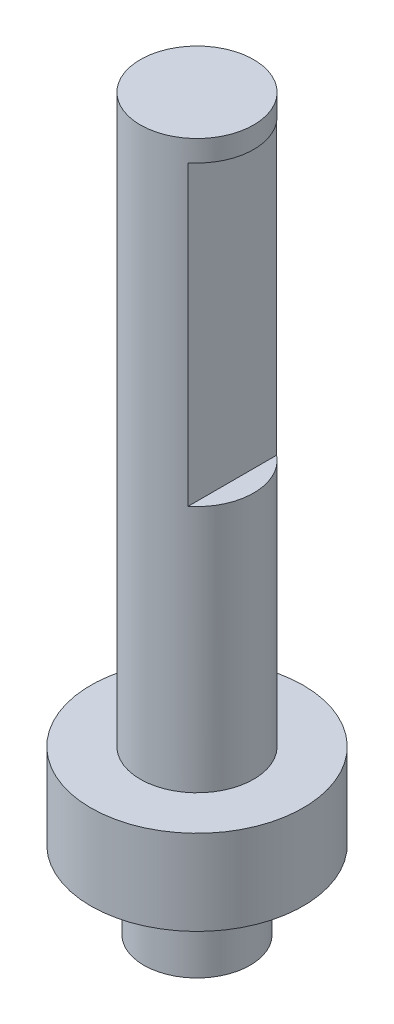
ISO-10303-21;
HEADER;
FILE_DESCRIPTION(('STEP AP214'),'2;1');
FILE_NAME('part.step','',(''),(''),'','','');
FILE_SCHEMA(('AUTOMOTIVE_DESIGN { 1 0 10303 214 1 1 1 1 }'));
ENDSEC;
DATA;
#1=APPLICATION_CONTEXT('core data for automotive mechanical design processes');
#2=APPLICATION_PROTOCOL_DEFINITION('international standard','automotive_design',2000,#1);
#3=PRODUCT_CONTEXT('',#1,'mechanical');
#4=PRODUCT('Part','Part','',(#3));
#5=PRODUCT_RELATED_PRODUCT_CATEGORY('part','',(#4));
#6=PRODUCT_DEFINITION_FORMATION('','',#4);
#7=PRODUCT_DEFINITION_CONTEXT('part definition',#1,'design');
#8=PRODUCT_DEFINITION('design','',#6,#7);
#9=PRODUCT_DEFINITION_SHAPE('','',#8);
#10=(LENGTH_UNIT() NAMED_UNIT(*) SI_UNIT(.MILLI.,.METRE.));
#11=(NAMED_UNIT(*) PLANE_ANGLE_UNIT() SI_UNIT($,.RADIAN.));
#12=(NAMED_UNIT(*) SI_UNIT($,.STERADIAN.) SOLID_ANGLE_UNIT());
#13=UNCERTAINTY_MEASURE_WITH_UNIT(LENGTH_MEASURE(1.E-05),#10,'distance_accuracy_value','');
#14=(GEOMETRIC_REPRESENTATION_CONTEXT(3) GLOBAL_UNCERTAINTY_ASSIGNED_CONTEXT((#13)) GLOBAL_UNIT_ASSIGNED_CONTEXT((#10,
#11,#12)) REPRESENTATION_CONTEXT('',''));
#15=CARTESIAN_POINT('',(0.,0.,0.));
#16=DIRECTION('',(0.,0.,1.));
#17=DIRECTION('',(1.,0.,0.));
#18=AXIS2_PLACEMENT_3D('',#15,#16,#17);
#19=CARTESIAN_POINT('',(0.,-11.,0.));
#20=DIRECTION('',(0.,1.,0.));
#21=DIRECTION('',(0.,0.,1.));
#22=AXIS2_PLACEMENT_3D('',#19,#20,#21);
#23=CYLINDRICAL_SURFACE('',#22,7.5);
#24=CARTESIAN_POINT('',(0.,-11.,0.));
#25=DIRECTION('',(0.,1.,0.));
#26=DIRECTION('',(0.,0.,1.));
#27=AXIS2_PLACEMENT_3D('',#24,#25,#26);
#28=CIRCLE('',#27,7.5);
#29=CARTESIAN_POINT('',(0.,-11.,7.5));
#30=VERTEX_POINT('',#29);
#31=EDGE_CURVE('E71',#30,#30,#28,.T.);
#32=ORIENTED_EDGE('',*,*,#31,.T.);
#33=EDGE_LOOP('',(#32));
#34=FACE_BOUND('',#33,.T.);
#35=CARTESIAN_POINT('',(0.,0.,0.));
#36=DIRECTION('',(0.,1.,0.));
#37=DIRECTION('',(0.,0.,1.));
#38=AXIS2_PLACEMENT_3D('',#35,#36,#37);
#39=CIRCLE('',#38,7.5);
#40=CARTESIAN_POINT('',(0.,0.,7.5));
#41=VERTEX_POINT('',#40);
#42=EDGE_CURVE('E72',#41,#41,#39,.T.);
#43=ORIENTED_EDGE('',*,*,#42,.F.);
#44=EDGE_LOOP('',(#43));
#45=FACE_BOUND('',#44,.T.);
#46=ADVANCED_FACE('F32',(#34,#45),#23,.T.);
#47=CARTESIAN_POINT('',(0.,-11.,0.));
#48=DIRECTION('',(0.,1.,0.));
#49=DIRECTION('',(0.,0.,1.));
#50=AXIS2_PLACEMENT_3D('',#47,#48,#49);
#51=PLANE('',#50);
#52=ORIENTED_EDGE('',*,*,#31,.F.);
#53=EDGE_LOOP('',(#52));
#54=FACE_BOUND('',#53,.T.);
#55=ADVANCED_FACE('F101',(#54),#51,.F.);
#56=CARTESIAN_POINT('',(0.,12.,0.));
#57=DIRECTION('',(0.,-1.,0.));
#58=DIRECTION('',(0.,0.,-1.));
#59=AXIS2_PLACEMENT_3D('',#56,#57,#58);
#60=CYLINDRICAL_SURFACE('',#59,15.);
#61=CARTESIAN_POINT('',(0.,12.,0.));
#62=DIRECTION('',(0.,1.,0.));
#63=DIRECTION('',(0.,0.,1.));
#64=AXIS2_PLACEMENT_3D('',#61,#62,#63);
#65=CIRCLE('',#64,15.);
#66=CARTESIAN_POINT('',(0.,12.,15.));
#67=VERTEX_POINT('',#66);
#68=EDGE_CURVE('E75',#67,#67,#65,.T.);
#69=ORIENTED_EDGE('',*,*,#68,.F.);
#70=EDGE_LOOP('',(#69));
#71=FACE_BOUND('',#70,.T.);
#72=CARTESIAN_POINT('',(0.,0.,0.));
#73=DIRECTION('',(0.,1.,0.));
#74=DIRECTION('',(0.,0.,1.));
#75=AXIS2_PLACEMENT_3D('',#72,#73,#74);
#76=CIRCLE('',#75,15.);
#77=CARTESIAN_POINT('',(0.,0.,15.));
#78=VERTEX_POINT('',#77);
#79=EDGE_CURVE('E78',#78,#78,#76,.T.);
#80=ORIENTED_EDGE('',*,*,#79,.T.);
#81=EDGE_LOOP('',(#80));
#82=FACE_BOUND('',#81,.T.);
#83=ADVANCED_FACE('F106',(#71,#82),#60,.T.);
#84=CARTESIAN_POINT('',(0.,12.,0.));
#85=DIRECTION('',(0.,1.,0.));
#86=DIRECTION('',(0.,0.,1.));
#87=AXIS2_PLACEMENT_3D('',#84,#85,#86);
#88=PLANE('',#87);
#89=CARTESIAN_POINT('',(0.,12.,0.));
#90=DIRECTION('',(0.,1.,0.));
#91=DIRECTION('',(0.,0.,1.));
#92=AXIS2_PLACEMENT_3D('',#89,#90,#91);
#93=CIRCLE('',#92,8.);
#94=CARTESIAN_POINT('',(0.,12.,8.));
#95=VERTEX_POINT('',#94);
#96=EDGE_CURVE('E84',#95,#95,#93,.T.);
#97=ORIENTED_EDGE('',*,*,#96,.F.);
#98=EDGE_LOOP('',(#97));
#99=FACE_BOUND('',#98,.T.);
#100=ORIENTED_EDGE('',*,*,#68,.T.);
#101=EDGE_LOOP('',(#100));
#102=FACE_BOUND('',#101,.T.);
#103=ADVANCED_FACE('F115',(#99,#102),#88,.T.);
#104=CARTESIAN_POINT('',(0.,0.,0.));
#105=DIRECTION('',(0.,1.,0.));
#106=DIRECTION('',(0.,0.,1.));
#107=AXIS2_PLACEMENT_3D('',#104,#105,#106);
#108=PLANE('',#107);
#109=ORIENTED_EDGE('',*,*,#42,.T.);
#110=EDGE_LOOP('',(#109));
#111=FACE_BOUND('',#110,.T.);
#112=ORIENTED_EDGE('',*,*,#79,.F.);
#113=EDGE_LOOP('',(#112));
#114=FACE_BOUND('',#113,.T.);
#115=ADVANCED_FACE('F112',(#111,#114),#108,.F.);
#116=CARTESIAN_POINT('',(0.,92.,0.));
#117=DIRECTION('',(0.,-1.,0.));
#118=DIRECTION('',(0.,0.,-1.));
#119=AXIS2_PLACEMENT_3D('',#116,#117,#118);
#120=CYLINDRICAL_SURFACE('',#119,8.);
#121=CARTESIAN_POINT('',(0.,89.,0.));
#122=DIRECTION('',(0.,1.,0.));
#123=DIRECTION('',(0.,0.,1.));
#124=AXIS2_PLACEMENT_3D('',#121,#122,#123);
#125=CIRCLE('',#124,8.);
#126=CARTESIAN_POINT('',(5.,89.,6.2449979983984));
#127=VERTEX_POINT('',#126);
#128=CARTESIAN_POINT('',(5.,89.,-6.2449979983984));
#129=VERTEX_POINT('',#128);
#130=EDGE_CURVE('E39',#127,#129,#125,.T.);
#131=ORIENTED_EDGE('',*,*,#130,.T.);
#132=DIRECTION('',(0.,-1.,0.));
#133=VECTOR('',#132,1.);
#134=CARTESIAN_POINT('',(5.,92.,-6.2449979983984));
#135=LINE('',#134,#133);
#136=CARTESIAN_POINT('',(5.,47.,-6.2449979983984));
#137=VERTEX_POINT('',#136);
#138=EDGE_CURVE('E11',#129,#137,#135,.T.);
#139=ORIENTED_EDGE('',*,*,#138,.T.);
#140=CARTESIAN_POINT('',(0.,47.,0.));
#141=DIRECTION('',(0.,1.,0.));
#142=DIRECTION('',(-1.,0.,0.));
#143=AXIS2_PLACEMENT_3D('',#140,#141,#142);
#144=CIRCLE('',#143,8.);
#145=CARTESIAN_POINT('',(5.,47.,6.2449979983984));
#146=VERTEX_POINT('',#145);
#147=EDGE_CURVE('E67',#146,#137,#144,.T.);
#148=ORIENTED_EDGE('',*,*,#147,.F.);
#149=DIRECTION('',(0.,-1.,0.));
#150=VECTOR('',#149,1.);
#151=CARTESIAN_POINT('',(5.,92.,6.2449979983984));
#152=LINE('',#151,#150);
#153=EDGE_CURVE('E51',#146,#127,#152,.F.);
#154=ORIENTED_EDGE('',*,*,#153,.T.);
#155=EDGE_LOOP('',(#131,#139,#148,#154));
#156=FACE_BOUND('',#155,.T.);
#157=CARTESIAN_POINT('',(0.,92.,0.));
#158=DIRECTION('',(0.,1.,0.));
#159=DIRECTION('',(0.,0.,1.));
#160=AXIS2_PLACEMENT_3D('',#157,#158,#159);
#161=CIRCLE('',#160,8.);
#162=CARTESIAN_POINT('',(0.,92.,8.));
#163=VERTEX_POINT('',#162);
#164=EDGE_CURVE('E81',#163,#163,#161,.T.);
#165=ORIENTED_EDGE('',*,*,#164,.F.);
#166=EDGE_LOOP('',(#165));
#167=FACE_BOUND('',#166,.T.);
#168=ORIENTED_EDGE('',*,*,#96,.T.);
#169=EDGE_LOOP('',(#168));
#170=FACE_BOUND('',#169,.T.);
#171=ADVANCED_FACE('F65',(#156,#167,#170),#120,.T.);
#172=CARTESIAN_POINT('',(0.,92.,0.));
#173=DIRECTION('',(0.,1.,0.));
#174=DIRECTION('',(0.,0.,1.));
#175=AXIS2_PLACEMENT_3D('',#172,#173,#174);
#176=PLANE('',#175);
#177=ORIENTED_EDGE('',*,*,#164,.T.);
#178=EDGE_LOOP('',(#177));
#179=FACE_BOUND('',#178,.T.);
#180=ADVANCED_FACE('F98',(#179),#176,.T.);
#181=CARTESIAN_POINT('',(14.8018185035471,89.,-40.));
#182=DIRECTION('',(0.,1.,0.));
#183=DIRECTION('',(0.,0.,1.));
#184=AXIS2_PLACEMENT_3D('',#181,#182,#183);
#185=PLANE('',#184);
#186=DIRECTION('',(0.,0.,1.));
#187=VECTOR('',#186,1.);
#188=CARTESIAN_POINT('',(5.,89.,-40.));
#189=LINE('',#188,#187);
#190=EDGE_CURVE('E46',#129,#127,#189,.T.);
#191=ORIENTED_EDGE('',*,*,#190,.F.);
#192=ORIENTED_EDGE('',*,*,#130,.F.);
#193=EDGE_LOOP('',(#191,#192));
#194=FACE_BOUND('',#193,.T.);
#195=ADVANCED_FACE('F63',(#194),#185,.F.);
#196=CARTESIAN_POINT('',(14.8018185035471,47.,-40.));
#197=DIRECTION('',(0.,1.,0.));
#198=DIRECTION('',(-1.,0.,0.));
#199=AXIS2_PLACEMENT_3D('',#196,#197,#198);
#200=PLANE('',#199);
#201=ORIENTED_EDGE('',*,*,#147,.T.);
#202=DIRECTION('',(0.,0.,1.));
#203=VECTOR('',#202,1.);
#204=CARTESIAN_POINT('',(5.,47.,-40.));
#205=LINE('',#204,#203);
#206=EDGE_CURVE('E58',#137,#146,#205,.T.);
#207=ORIENTED_EDGE('',*,*,#206,.T.);
#208=EDGE_LOOP('',(#201,#207));
#209=FACE_BOUND('',#208,.T.);
#210=ADVANCED_FACE('F90',(#209),#200,.T.);
#211=CARTESIAN_POINT('',(5.,89.,-40.));
#212=DIRECTION('',(-1.,0.,0.));
#213=DIRECTION('',(0.,-1.,0.));
#214=AXIS2_PLACEMENT_3D('',#211,#212,#213);
#215=PLANE('',#214);
#216=ORIENTED_EDGE('',*,*,#190,.T.);
#217=ORIENTED_EDGE('',*,*,#153,.F.);
#218=ORIENTED_EDGE('',*,*,#206,.F.);
#219=ORIENTED_EDGE('',*,*,#138,.F.);
#220=EDGE_LOOP('',(#216,#217,#218,#219));
#221=FACE_BOUND('',#220,.T.);
#222=ADVANCED_FACE('F57',(#221),#215,.F.);
#223=CLOSED_SHELL('',(#46,#55,#83,#103,#115,#171,#180,#195,#210,#222));
#224=MANIFOLD_SOLID_BREP('B2',#223);
#225=ADVANCED_BREP_SHAPE_REPRESENTATION('',(#18,#224),#14);
#226=SHAPE_DEFINITION_REPRESENTATION(#9,#225);
ENDSEC;
END-ISO-10303-21;
